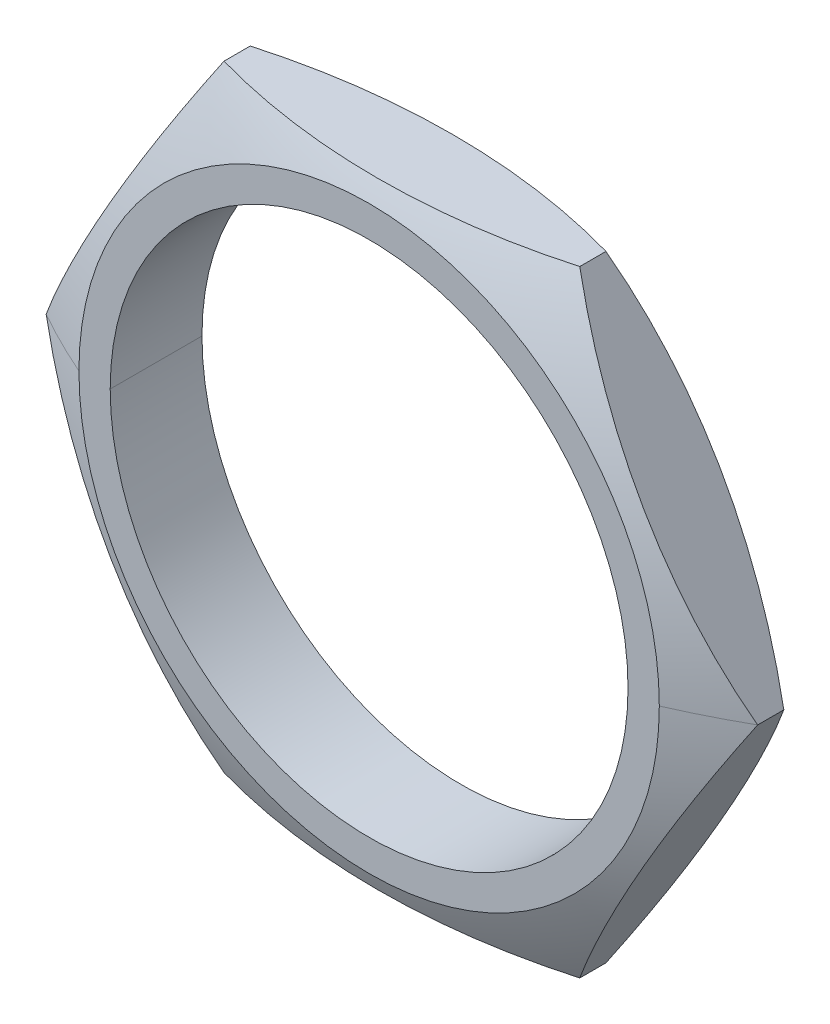
ISO-10303-21;
HEADER;
FILE_DESCRIPTION(('STEP AP214'),'2;1');
FILE_NAME('part.step','',(''),(''),'','','');
FILE_SCHEMA(('AUTOMOTIVE_DESIGN { 1 0 10303 214 1 1 1 1 }'));
ENDSEC;
DATA;
#1=APPLICATION_CONTEXT('core data for automotive mechanical design processes');
#2=APPLICATION_PROTOCOL_DEFINITION('international standard','automotive_design',2000,#1);
#3=PRODUCT_CONTEXT('',#1,'mechanical');
#4=PRODUCT('Part','Part','',(#3));
#5=PRODUCT_RELATED_PRODUCT_CATEGORY('part','',(#4));
#6=PRODUCT_DEFINITION_FORMATION('','',#4);
#7=PRODUCT_DEFINITION_CONTEXT('part definition',#1,'design');
#8=PRODUCT_DEFINITION('design','',#6,#7);
#9=PRODUCT_DEFINITION_SHAPE('','',#8);
#10=(LENGTH_UNIT() NAMED_UNIT(*) SI_UNIT(.MILLI.,.METRE.));
#11=(NAMED_UNIT(*) PLANE_ANGLE_UNIT() SI_UNIT($,.RADIAN.));
#12=(NAMED_UNIT(*) SI_UNIT($,.STERADIAN.) SOLID_ANGLE_UNIT());
#13=UNCERTAINTY_MEASURE_WITH_UNIT(LENGTH_MEASURE(1.E-05),#10,'distance_accuracy_value','');
#14=(GEOMETRIC_REPRESENTATION_CONTEXT(3) GLOBAL_UNCERTAINTY_ASSIGNED_CONTEXT((#13)) GLOBAL_UNIT_ASSIGNED_CONTEXT((#10,
#11,#12)) REPRESENTATION_CONTEXT('',''));
#15=CARTESIAN_POINT('',(0.,0.,0.));
#16=DIRECTION('',(0.,0.,1.));
#17=DIRECTION('',(1.,0.,0.));
#18=AXIS2_PLACEMENT_3D('',#15,#16,#17);
#19=CARTESIAN_POINT('',(0.,0.,-18.80837012153));
#20=DIRECTION('',(0.,1.,0.));
#21=DIRECTION('',(-1.,0.,0.));
#22=AXIS2_PLACEMENT_3D('',#19,#20,#21);
#23=SPHERICAL_SURFACE('',#22,22.0629738716026);
#24=CARTESIAN_POINT('',(0.,0.,-18.80837012153));
#25=DIRECTION('',(0.,1.,0.));
#26=DIRECTION('',(-1.,0.,0.));
#27=AXIS2_PLACEMENT_3D('',#24,#25,#26);
#28=CIRCLE('',#27,22.0629738716026);
#29=CARTESIAN_POINT('',(8.85418506076498,0.,1.4));
#30=VERTEX_POINT('',#29);
#31=CARTESIAN_POINT('',(10.854185060765,0.,0.4));
#32=VERTEX_POINT('',#31);
#33=EDGE_CURVE('E209',#30,#32,#28,.T.);
#34=ORIENTED_EDGE('',*,*,#33,.F.);
#35=CARTESIAN_POINT('',(0.,0.,1.4));
#36=DIRECTION('',(0.,0.,1.));
#37=DIRECTION('',(1.,0.,0.));
#38=AXIS2_PLACEMENT_3D('',#35,#36,#37);
#39=CIRCLE('',#38,8.85418506076498);
#40=CARTESIAN_POINT('',(-8.85418506076498,0.,1.4));
#41=VERTEX_POINT('',#40);
#42=EDGE_CURVE('E20',#41,#30,#39,.T.);
#43=ORIENTED_EDGE('',*,*,#42,.F.);
#44=CARTESIAN_POINT('',(0.,0.,-18.80837012153));
#45=DIRECTION('',(0.,-1.,0.));
#46=DIRECTION('',(0.,0.,-1.));
#47=AXIS2_PLACEMENT_3D('',#44,#45,#46);
#48=CIRCLE('',#47,22.0629738716026);
#49=CARTESIAN_POINT('',(-10.854185060765,0.,0.4));
#50=VERTEX_POINT('',#49);
#51=EDGE_CURVE('E159',#41,#50,#48,.T.);
#52=ORIENTED_EDGE('',*,*,#51,.T.);
#53=CARTESIAN_POINT('',(-8.14063879557368,-4.70000000000007,-18.80837012153));
#54=DIRECTION('',(0.866025403784435,0.500000000000007,0.));
#55=DIRECTION('',(-0.500000000000007,0.866025403784435,0.));
#56=AXIS2_PLACEMENT_3D('',#53,#54,#55);
#57=CIRCLE('',#56,19.9603310608572);
#58=CARTESIAN_POINT('',(-5.4270925303824,-9.4,0.400000000000005));
#59=VERTEX_POINT('',#58);
#60=EDGE_CURVE('E165',#50,#59,#57,.T.);
#61=ORIENTED_EDGE('',*,*,#60,.T.);
#62=CARTESIAN_POINT('',(0.,-9.4,-18.80837012153));
#63=DIRECTION('',(0.,1.,0.));
#64=DIRECTION('',(-1.,0.,0.));
#65=AXIS2_PLACEMENT_3D('',#62,#63,#64);
#66=CIRCLE('',#65,19.9603310608572);
#67=CARTESIAN_POINT('',(5.4270925303826,-9.4,0.4));
#68=VERTEX_POINT('',#67);
#69=EDGE_CURVE('E41',#59,#68,#66,.T.);
#70=ORIENTED_EDGE('',*,*,#69,.T.);
#71=CARTESIAN_POINT('',(8.14063879557378,-4.7,-18.80837012153));
#72=DIRECTION('',(-0.866025403784442,0.5,0.));
#73=DIRECTION('',(-0.5,-0.866025403784442,0.));
#74=AXIS2_PLACEMENT_3D('',#71,#72,#73);
#75=CIRCLE('',#74,19.9603310608571);
#76=EDGE_CURVE('E192',#68,#32,#75,.T.);
#77=ORIENTED_EDGE('',*,*,#76,.T.);
#78=EDGE_LOOP('',(#34,#43,#52,#61,#70,#77));
#79=FACE_BOUND('',#78,.T.);
#80=ADVANCED_FACE('F16',(#79),#23,.T.);
#81=CARTESIAN_POINT('',(0.,0.,18.80837012153));
#82=DIRECTION('',(0.,-1.,0.));
#83=DIRECTION('',(-1.,0.,0.));
#84=AXIS2_PLACEMENT_3D('',#81,#82,#83);
#85=SPHERICAL_SURFACE('',#84,22.0629738716026);
#86=CARTESIAN_POINT('',(0.,0.,18.80837012153));
#87=DIRECTION('',(0.,-1.,0.));
#88=DIRECTION('',(1.,0.,0.));
#89=AXIS2_PLACEMENT_3D('',#86,#87,#88);
#90=CIRCLE('',#89,22.0629738716026);
#91=CARTESIAN_POINT('',(8.85418506076498,0.,-1.4));
#92=VERTEX_POINT('',#91);
#93=CARTESIAN_POINT('',(10.854185060765,0.,-0.4));
#94=VERTEX_POINT('',#93);
#95=EDGE_CURVE('E118',#92,#94,#90,.T.);
#96=ORIENTED_EDGE('',*,*,#95,.F.);
#97=CARTESIAN_POINT('',(0.,0.,-1.4));
#98=DIRECTION('',(0.,0.,1.));
#99=DIRECTION('',(1.,0.,0.));
#100=AXIS2_PLACEMENT_3D('',#97,#98,#99);
#101=CIRCLE('',#100,8.85418506076498);
#102=CARTESIAN_POINT('',(-8.85418506076498,0.,-1.4));
#103=VERTEX_POINT('',#102);
#104=EDGE_CURVE('E27',#92,#103,#101,.T.);
#105=ORIENTED_EDGE('',*,*,#104,.T.);
#106=CARTESIAN_POINT('',(0.,0.,18.80837012153));
#107=DIRECTION('',(0.,1.,0.));
#108=DIRECTION('',(0.,0.,1.));
#109=AXIS2_PLACEMENT_3D('',#106,#107,#108);
#110=CIRCLE('',#109,22.0629738716026);
#111=CARTESIAN_POINT('',(-10.854185060765,0.,-0.4));
#112=VERTEX_POINT('',#111);
#113=EDGE_CURVE('E228',#103,#112,#110,.T.);
#114=ORIENTED_EDGE('',*,*,#113,.T.);
#115=CARTESIAN_POINT('',(-8.14063879557375,4.7,18.80837012153));
#116=DIRECTION('',(0.866025403784442,-0.5,0.));
#117=DIRECTION('',(0.5,0.866025403784442,0.));
#118=AXIS2_PLACEMENT_3D('',#115,#116,#117);
#119=CIRCLE('',#118,19.9603310608572);
#120=CARTESIAN_POINT('',(-5.42709253038253,9.4,-0.4));
#121=VERTEX_POINT('',#120);
#122=EDGE_CURVE('E163',#112,#121,#119,.T.);
#123=ORIENTED_EDGE('',*,*,#122,.T.);
#124=CARTESIAN_POINT('',(0.,9.4,18.80837012153));
#125=DIRECTION('',(0.,-1.,0.));
#126=DIRECTION('',(1.,0.,0.));
#127=AXIS2_PLACEMENT_3D('',#124,#125,#126);
#128=CIRCLE('',#127,19.9603310608572);
#129=CARTESIAN_POINT('',(5.42709253038247,9.4,-0.4));
#130=VERTEX_POINT('',#129);
#131=EDGE_CURVE('E121',#121,#130,#128,.T.);
#132=ORIENTED_EDGE('',*,*,#131,.T.);
#133=CARTESIAN_POINT('',(8.14063879557372,4.7,18.80837012153));
#134=DIRECTION('',(-0.866025403784438,-0.5,0.));
#135=DIRECTION('',(0.5,-0.866025403784438,0.));
#136=AXIS2_PLACEMENT_3D('',#133,#134,#135);
#137=CIRCLE('',#136,19.9603310608572);
#138=EDGE_CURVE('E114',#130,#94,#137,.T.);
#139=ORIENTED_EDGE('',*,*,#138,.T.);
#140=EDGE_LOOP('',(#96,#105,#114,#123,#132,#139));
#141=FACE_BOUND('',#140,.T.);
#142=ADVANCED_FACE('F116',(#141),#85,.T.);
#143=CARTESIAN_POINT('',(0.,0.,1.4));
#144=DIRECTION('',(0.,0.,-1.));
#145=DIRECTION('',(-1.,0.,0.));
#146=AXIS2_PLACEMENT_3D('',#143,#144,#145);
#147=CYLINDRICAL_SURFACE('',#146,7.9);
#148=DIRECTION('',(0.,0.,-1.));
#149=VECTOR('',#148,1.);
#150=CARTESIAN_POINT('',(7.9,0.,1.4));
#151=LINE('',#150,#149);
#152=CARTESIAN_POINT('',(7.9,0.,1.4));
#153=VERTEX_POINT('',#152);
#154=CARTESIAN_POINT('',(7.9,0.,-1.4));
#155=VERTEX_POINT('',#154);
#156=EDGE_CURVE('E178',#153,#155,#151,.T.);
#157=ORIENTED_EDGE('',*,*,#156,.F.);
#158=CARTESIAN_POINT('',(0.,0.,1.4));
#159=DIRECTION('',(0.,0.,1.));
#160=DIRECTION('',(1.,0.,0.));
#161=AXIS2_PLACEMENT_3D('',#158,#159,#160);
#162=CIRCLE('',#161,7.9);
#163=CARTESIAN_POINT('',(-7.9,0.,1.4));
#164=VERTEX_POINT('',#163);
#165=EDGE_CURVE('E177',#153,#164,#162,.T.);
#166=ORIENTED_EDGE('',*,*,#165,.T.);
#167=DIRECTION('',(0.,0.,-1.));
#168=VECTOR('',#167,1.);
#169=CARTESIAN_POINT('',(-7.9,0.,1.4));
#170=LINE('',#169,#168);
#171=CARTESIAN_POINT('',(-7.9,0.,-1.4));
#172=VERTEX_POINT('',#171);
#173=EDGE_CURVE('E195',#164,#172,#170,.T.);
#174=ORIENTED_EDGE('',*,*,#173,.T.);
#175=CARTESIAN_POINT('',(0.,0.,-1.4));
#176=DIRECTION('',(0.,0.,1.));
#177=DIRECTION('',(1.,0.,0.));
#178=AXIS2_PLACEMENT_3D('',#175,#176,#177);
#179=CIRCLE('',#178,7.9);
#180=EDGE_CURVE('E10',#155,#172,#179,.T.);
#181=ORIENTED_EDGE('',*,*,#180,.F.);
#182=EDGE_LOOP('',(#157,#166,#174,#181));
#183=FACE_BOUND('',#182,.T.);
#184=ADVANCED_FACE('F384',(#183),#147,.F.);
#185=CARTESIAN_POINT('',(0.,0.,-1.4));
#186=DIRECTION('',(0.,0.,1.));
#187=DIRECTION('',(1.,0.,0.));
#188=AXIS2_PLACEMENT_3D('',#185,#186,#187);
#189=PLANE('',#188);
#190=CARTESIAN_POINT('',(0.,0.,-1.4));
#191=DIRECTION('',(0.,0.,1.));
#192=DIRECTION('',(1.,0.,0.));
#193=AXIS2_PLACEMENT_3D('',#190,#191,#192);
#194=CIRCLE('',#193,7.9);
#195=EDGE_CURVE('E182',#172,#155,#194,.T.);
#196=ORIENTED_EDGE('',*,*,#195,.T.);
#197=ORIENTED_EDGE('',*,*,#180,.T.);
#198=EDGE_LOOP('',(#196,#197));
#199=FACE_BOUND('',#198,.T.);
#200=CARTESIAN_POINT('',(0.,0.,-1.4));
#201=DIRECTION('',(0.,0.,1.));
#202=DIRECTION('',(1.,0.,0.));
#203=AXIS2_PLACEMENT_3D('',#200,#201,#202);
#204=CIRCLE('',#203,8.85418506076498);
#205=EDGE_CURVE('E152',#103,#92,#204,.T.);
#206=ORIENTED_EDGE('',*,*,#205,.F.);
#207=ORIENTED_EDGE('',*,*,#104,.F.);
#208=EDGE_LOOP('',(#206,#207));
#209=FACE_BOUND('',#208,.T.);
#210=ADVANCED_FACE('F404',(#199,#209),#189,.F.);
#211=CARTESIAN_POINT('',(0.,0.,1.4));
#212=DIRECTION('',(0.,0.,1.));
#213=DIRECTION('',(1.,0.,0.));
#214=AXIS2_PLACEMENT_3D('',#211,#212,#213);
#215=PLANE('',#214);
#216=CARTESIAN_POINT('',(0.,0.,1.4));
#217=DIRECTION('',(0.,0.,1.));
#218=DIRECTION('',(1.,0.,0.));
#219=AXIS2_PLACEMENT_3D('',#216,#217,#218);
#220=CIRCLE('',#219,7.9);
#221=EDGE_CURVE('E183',#164,#153,#220,.T.);
#222=ORIENTED_EDGE('',*,*,#221,.F.);
#223=ORIENTED_EDGE('',*,*,#165,.F.);
#224=EDGE_LOOP('',(#222,#223));
#225=FACE_BOUND('',#224,.T.);
#226=ORIENTED_EDGE('',*,*,#42,.T.);
#227=CARTESIAN_POINT('',(0.,0.,1.4));
#228=DIRECTION('',(0.,0.,1.));
#229=DIRECTION('',(1.,0.,0.));
#230=AXIS2_PLACEMENT_3D('',#227,#228,#229);
#231=CIRCLE('',#230,8.85418506076498);
#232=EDGE_CURVE('E214',#30,#41,#231,.T.);
#233=ORIENTED_EDGE('',*,*,#232,.T.);
#234=EDGE_LOOP('',(#226,#233));
#235=FACE_BOUND('',#234,.T.);
#236=ADVANCED_FACE('F438',(#225,#235),#215,.T.);
#237=CARTESIAN_POINT('',(-5.4270925303824,-9.4,1.4));
#238=DIRECTION('',(0.,1.,0.));
#239=DIRECTION('',(1.,0.,0.));
#240=AXIS2_PLACEMENT_3D('',#237,#238,#239);
#241=PLANE('',#240);
#242=ORIENTED_EDGE('',*,*,#69,.F.);
#243=DIRECTION('',(0.,0.,-1.));
#244=VECTOR('',#243,1.);
#245=CARTESIAN_POINT('',(-5.4270925303824,-9.4,1.4));
#246=LINE('',#245,#244);
#247=CARTESIAN_POINT('',(-5.4270925303824,-9.4,-0.4));
#248=VERTEX_POINT('',#247);
#249=EDGE_CURVE('E169',#59,#248,#246,.T.);
#250=ORIENTED_EDGE('',*,*,#249,.T.);
#251=CARTESIAN_POINT('',(0.,-9.4,18.80837012153));
#252=DIRECTION('',(0.,1.,0.));
#253=DIRECTION('',(-1.,0.,0.));
#254=AXIS2_PLACEMENT_3D('',#251,#252,#253);
#255=CIRCLE('',#254,19.9603310608572);
#256=CARTESIAN_POINT('',(5.4270925303826,-9.4,-0.400000000000005));
#257=VERTEX_POINT('',#256);
#258=EDGE_CURVE('E147',#257,#248,#255,.T.);
#259=ORIENTED_EDGE('',*,*,#258,.F.);
#260=DIRECTION('',(0.,0.,-1.));
#261=VECTOR('',#260,1.);
#262=CARTESIAN_POINT('',(5.4270925303826,-9.4,1.4));
#263=LINE('',#262,#261);
#264=EDGE_CURVE('E138',#68,#257,#263,.T.);
#265=ORIENTED_EDGE('',*,*,#264,.F.);
#266=EDGE_LOOP('',(#242,#250,#259,#265));
#267=FACE_BOUND('',#266,.T.);
#268=ADVANCED_FACE('F433',(#267),#241,.F.);
#269=CARTESIAN_POINT('',(-10.854185060765,0.,1.4));
#270=DIRECTION('',(0.866025403784435,0.500000000000007,0.));
#271=DIRECTION('',(0.,0.,-1.));
#272=AXIS2_PLACEMENT_3D('',#269,#270,#271);
#273=PLANE('',#272);
#274=ORIENTED_EDGE('',*,*,#60,.F.);
#275=DIRECTION('',(0.,0.,-1.));
#276=VECTOR('',#275,1.);
#277=CARTESIAN_POINT('',(-10.854185060765,0.,1.4));
#278=LINE('',#277,#276);
#279=EDGE_CURVE('E170',#50,#112,#278,.T.);
#280=ORIENTED_EDGE('',*,*,#279,.T.);
#281=CARTESIAN_POINT('',(-8.14063879557368,-4.70000000000007,18.80837012153));
#282=DIRECTION('',(0.866025403784435,0.500000000000007,0.));
#283=DIRECTION('',(-0.500000000000007,0.866025403784435,0.));
#284=AXIS2_PLACEMENT_3D('',#281,#282,#283);
#285=CIRCLE('',#284,19.9603310608572);
#286=EDGE_CURVE('E186',#248,#112,#285,.T.);
#287=ORIENTED_EDGE('',*,*,#286,.F.);
#288=ORIENTED_EDGE('',*,*,#249,.F.);
#289=EDGE_LOOP('',(#274,#280,#287,#288));
#290=FACE_BOUND('',#289,.T.);
#291=ADVANCED_FACE('F437',(#290),#273,.F.);
#292=CARTESIAN_POINT('',(-5.42709253038253,9.4,1.4));
#293=DIRECTION('',(0.866025403784442,-0.5,0.));
#294=DIRECTION('',(0.,0.,-1.));
#295=AXIS2_PLACEMENT_3D('',#292,#293,#294);
#296=PLANE('',#295);
#297=CARTESIAN_POINT('',(-8.14063879557375,4.7,-18.80837012153));
#298=DIRECTION('',(0.866025403784442,-0.5,0.));
#299=DIRECTION('',(0.5,0.866025403784442,0.));
#300=AXIS2_PLACEMENT_3D('',#297,#298,#299);
#301=CIRCLE('',#300,19.9603310608572);
#302=CARTESIAN_POINT('',(-5.42709253038253,9.4,0.4));
#303=VERTEX_POINT('',#302);
#304=EDGE_CURVE('E187',#303,#50,#301,.T.);
#305=ORIENTED_EDGE('',*,*,#304,.F.);
#306=DIRECTION('',(0.,0.,-1.));
#307=VECTOR('',#306,1.);
#308=CARTESIAN_POINT('',(-5.42709253038253,9.4,1.4));
#309=LINE('',#308,#307);
#310=EDGE_CURVE('E171',#303,#121,#309,.T.);
#311=ORIENTED_EDGE('',*,*,#310,.T.);
#312=ORIENTED_EDGE('',*,*,#122,.F.);
#313=ORIENTED_EDGE('',*,*,#279,.F.);
#314=EDGE_LOOP('',(#305,#311,#312,#313));
#315=FACE_BOUND('',#314,.T.);
#316=ADVANCED_FACE('F18',(#315),#296,.F.);
#317=CARTESIAN_POINT('',(5.42709253038246,9.4,1.4));
#318=DIRECTION('',(0.,-1.,0.));
#319=DIRECTION('',(0.,0.,-1.));
#320=AXIS2_PLACEMENT_3D('',#317,#318,#319);
#321=PLANE('',#320);
#322=CARTESIAN_POINT('',(0.,9.4,-18.80837012153));
#323=DIRECTION('',(0.,-1.,0.));
#324=DIRECTION('',(1.,0.,0.));
#325=AXIS2_PLACEMENT_3D('',#322,#323,#324);
#326=CIRCLE('',#325,19.9603310608572);
#327=CARTESIAN_POINT('',(5.42709253038247,9.4,0.4));
#328=VERTEX_POINT('',#327);
#329=EDGE_CURVE('E190',#328,#303,#326,.T.);
#330=ORIENTED_EDGE('',*,*,#329,.F.);
#331=DIRECTION('',(0.,0.,-1.));
#332=VECTOR('',#331,1.);
#333=CARTESIAN_POINT('',(5.42709253038246,9.4,1.4));
#334=LINE('',#333,#332);
#335=EDGE_CURVE('E125',#328,#130,#334,.T.);
#336=ORIENTED_EDGE('',*,*,#335,.T.);
#337=ORIENTED_EDGE('',*,*,#131,.F.);
#338=ORIENTED_EDGE('',*,*,#310,.F.);
#339=EDGE_LOOP('',(#330,#336,#337,#338));
#340=FACE_BOUND('',#339,.T.);
#341=ADVANCED_FACE('F412',(#340),#321,.F.);
#342=CARTESIAN_POINT('',(10.854185060765,0.,1.4));
#343=DIRECTION('',(-0.866025403784438,-0.5,0.));
#344=DIRECTION('',(-0.5,0.866025403784438,0.));
#345=AXIS2_PLACEMENT_3D('',#342,#343,#344);
#346=PLANE('',#345);
#347=CARTESIAN_POINT('',(8.14063879557372,4.7,-18.80837012153));
#348=DIRECTION('',(-0.866025403784438,-0.5,0.));
#349=DIRECTION('',(0.5,-0.866025403784438,0.));
#350=AXIS2_PLACEMENT_3D('',#347,#348,#349);
#351=CIRCLE('',#350,19.9603310608572);
#352=EDGE_CURVE('E132',#32,#328,#351,.T.);
#353=ORIENTED_EDGE('',*,*,#352,.F.);
#354=DIRECTION('',(0.,0.,-1.));
#355=VECTOR('',#354,1.);
#356=CARTESIAN_POINT('',(10.854185060765,0.,1.4));
#357=LINE('',#356,#355);
#358=EDGE_CURVE('E126',#32,#94,#357,.T.);
#359=ORIENTED_EDGE('',*,*,#358,.T.);
#360=ORIENTED_EDGE('',*,*,#138,.F.);
#361=ORIENTED_EDGE('',*,*,#335,.F.);
#362=EDGE_LOOP('',(#353,#359,#360,#361));
#363=FACE_BOUND('',#362,.T.);
#364=ADVANCED_FACE('F130',(#363),#346,.F.);
#365=CARTESIAN_POINT('',(5.4270925303826,-9.4,1.4));
#366=DIRECTION('',(-0.866025403784442,0.5,0.));
#367=DIRECTION('',(0.,0.,1.));
#368=AXIS2_PLACEMENT_3D('',#365,#366,#367);
#369=PLANE('',#368);
#370=ORIENTED_EDGE('',*,*,#76,.F.);
#371=ORIENTED_EDGE('',*,*,#264,.T.);
#372=CARTESIAN_POINT('',(8.14063879557378,-4.7,18.80837012153));
#373=DIRECTION('',(-0.866025403784442,0.5,0.));
#374=DIRECTION('',(-0.5,-0.866025403784442,0.));
#375=AXIS2_PLACEMENT_3D('',#372,#373,#374);
#376=CIRCLE('',#375,19.9603310608571);
#377=EDGE_CURVE('E141',#94,#257,#376,.T.);
#378=ORIENTED_EDGE('',*,*,#377,.F.);
#379=ORIENTED_EDGE('',*,*,#358,.F.);
#380=EDGE_LOOP('',(#370,#371,#378,#379));
#381=FACE_BOUND('',#380,.T.);
#382=ADVANCED_FACE('F142',(#381),#369,.F.);
#383=CARTESIAN_POINT('',(0.,0.,1.4));
#384=DIRECTION('',(0.,0.,-1.));
#385=DIRECTION('',(-1.,0.,0.));
#386=AXIS2_PLACEMENT_3D('',#383,#384,#385);
#387=CYLINDRICAL_SURFACE('',#386,7.9);
#388=ORIENTED_EDGE('',*,*,#221,.T.);
#389=ORIENTED_EDGE('',*,*,#156,.T.);
#390=ORIENTED_EDGE('',*,*,#195,.F.);
#391=ORIENTED_EDGE('',*,*,#173,.F.);
#392=EDGE_LOOP('',(#388,#389,#390,#391));
#393=FACE_BOUND('',#392,.T.);
#394=ADVANCED_FACE('F426',(#393),#387,.F.);
#395=CARTESIAN_POINT('',(0.,0.,18.80837012153));
#396=DIRECTION('',(0.,-1.,0.));
#397=DIRECTION('',(-1.,0.,0.));
#398=AXIS2_PLACEMENT_3D('',#395,#396,#397);
#399=SPHERICAL_SURFACE('',#398,22.0629738716026);
#400=ORIENTED_EDGE('',*,*,#205,.T.);
#401=ORIENTED_EDGE('',*,*,#95,.T.);
#402=ORIENTED_EDGE('',*,*,#377,.T.);
#403=ORIENTED_EDGE('',*,*,#258,.T.);
#404=ORIENTED_EDGE('',*,*,#286,.T.);
#405=ORIENTED_EDGE('',*,*,#113,.F.);
#406=EDGE_LOOP('',(#400,#401,#402,#403,#404,#405));
#407=FACE_BOUND('',#406,.T.);
#408=ADVANCED_FACE('F149',(#407),#399,.T.);
#409=CARTESIAN_POINT('',(0.,0.,-18.80837012153));
#410=DIRECTION('',(0.,1.,0.));
#411=DIRECTION('',(-1.,0.,0.));
#412=AXIS2_PLACEMENT_3D('',#409,#410,#411);
#413=SPHERICAL_SURFACE('',#412,22.0629738716026);
#414=ORIENTED_EDGE('',*,*,#232,.F.);
#415=ORIENTED_EDGE('',*,*,#33,.T.);
#416=ORIENTED_EDGE('',*,*,#352,.T.);
#417=ORIENTED_EDGE('',*,*,#329,.T.);
#418=ORIENTED_EDGE('',*,*,#304,.T.);
#419=ORIENTED_EDGE('',*,*,#51,.F.);
#420=EDGE_LOOP('',(#414,#415,#416,#417,#418,#419));
#421=FACE_BOUND('',#420,.T.);
#422=ADVANCED_FACE('F391',(#421),#413,.T.);
#423=CLOSED_SHELL('',(#80,#142,#184,#210,#236,#268,#291,#316,#341,#364,#382,#394,#408,#422));
#424=MANIFOLD_SOLID_BREP('B1',#423);
#425=ADVANCED_BREP_SHAPE_REPRESENTATION('',(#18,#424),#14);
#426=SHAPE_DEFINITION_REPRESENTATION(#9,#425);
ENDSEC;
END-ISO-10303-21;
